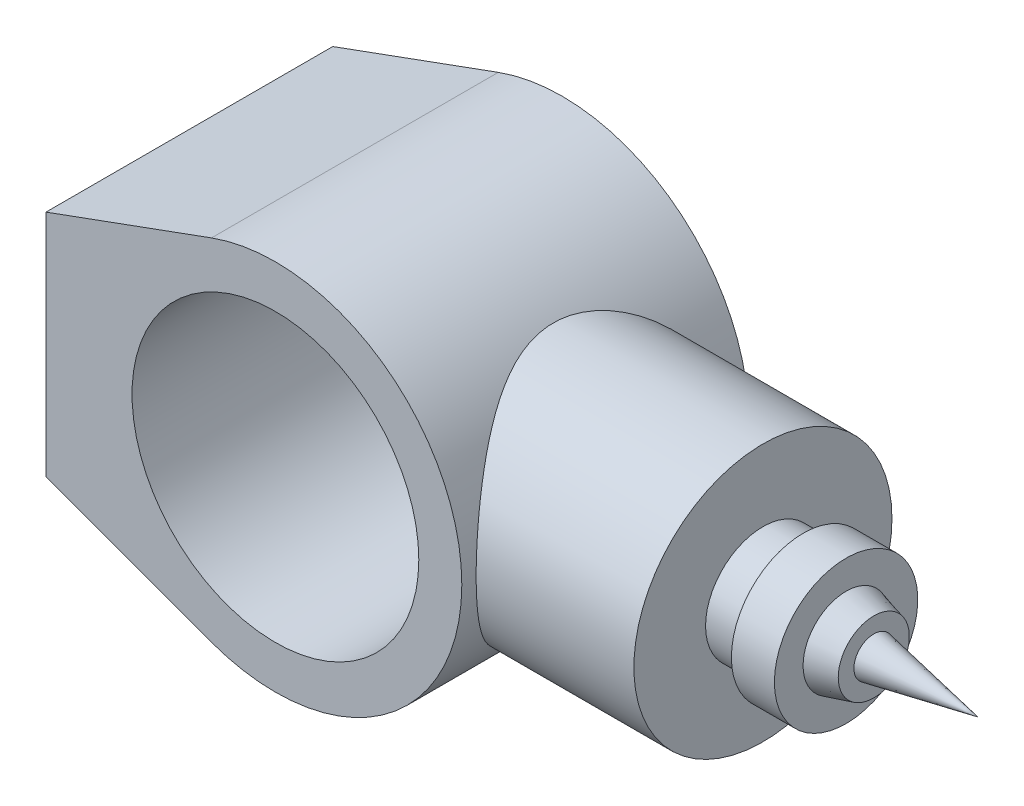
ISO-10303-21;
HEADER;
FILE_DESCRIPTION(('STEP AP214'),'2;1');
FILE_NAME('part.step','',(''),(''),'','','');
FILE_SCHEMA(('AUTOMOTIVE_DESIGN { 1 0 10303 214 1 1 1 1 }'));
ENDSEC;
DATA;
#1=APPLICATION_CONTEXT('core data for automotive mechanical design processes');
#2=APPLICATION_PROTOCOL_DEFINITION('international standard','automotive_design',2000,#1);
#3=PRODUCT_CONTEXT('',#1,'mechanical');
#4=PRODUCT('Part','Part','',(#3));
#5=PRODUCT_RELATED_PRODUCT_CATEGORY('part','',(#4));
#6=PRODUCT_DEFINITION_FORMATION('','',#4);
#7=PRODUCT_DEFINITION_CONTEXT('part definition',#1,'design');
#8=PRODUCT_DEFINITION('design','',#6,#7);
#9=PRODUCT_DEFINITION_SHAPE('','',#8);
#10=(LENGTH_UNIT() NAMED_UNIT(*) SI_UNIT(.MILLI.,.METRE.));
#11=(NAMED_UNIT(*) PLANE_ANGLE_UNIT() SI_UNIT($,.RADIAN.));
#12=(NAMED_UNIT(*) SI_UNIT($,.STERADIAN.) SOLID_ANGLE_UNIT());
#13=UNCERTAINTY_MEASURE_WITH_UNIT(LENGTH_MEASURE(1.E-05),#10,'distance_accuracy_value','');
#14=(GEOMETRIC_REPRESENTATION_CONTEXT(3) GLOBAL_UNCERTAINTY_ASSIGNED_CONTEXT((#13)) GLOBAL_UNIT_ASSIGNED_CONTEXT((#10,
#11,#12)) REPRESENTATION_CONTEXT('',''));
#15=CARTESIAN_POINT('',(0.,0.,0.));
#16=DIRECTION('',(0.,0.,1.));
#17=DIRECTION('',(1.,0.,0.));
#18=AXIS2_PLACEMENT_3D('',#15,#16,#17);
#19=CARTESIAN_POINT('',(0.,0.,50.));
#20=DIRECTION('',(0.,0.,1.));
#21=DIRECTION('',(1.,0.,0.));
#22=AXIS2_PLACEMENT_3D('',#19,#20,#21);
#23=PLANE('',#22);
#24=DIRECTION('',(-0.939410286372225,-0.342794856813887,0.));
#25=VECTOR('',#24,1.);
#26=CARTESIAN_POINT('',(-80.,40.,50.));
#27=LINE('',#26,#25);
#28=CARTESIAN_POINT('',(-22.2816656929027,61.0616686141947,50.));
#29=VERTEX_POINT('',#28);
#30=CARTESIAN_POINT('',(-80.,40.,50.));
#31=VERTEX_POINT('',#30);
#32=EDGE_CURVE('E205',#29,#31,#27,.T.);
#33=ORIENTED_EDGE('',*,*,#32,.T.);
#34=DIRECTION('',(0.,-1.,0.));
#35=VECTOR('',#34,1.);
#36=CARTESIAN_POINT('',(-80.,-40.,50.));
#37=LINE('',#36,#35);
#38=CARTESIAN_POINT('',(-80.,-40.,50.));
#39=VERTEX_POINT('',#38);
#40=EDGE_CURVE('E95',#31,#39,#37,.T.);
#41=ORIENTED_EDGE('',*,*,#40,.T.);
#42=DIRECTION('',(0.939410286372225,-0.342794856813887,0.));
#43=VECTOR('',#42,1.);
#44=CARTESIAN_POINT('',(-80.,-40.,50.));
#45=LINE('',#44,#43);
#46=CARTESIAN_POINT('',(-22.2816656929027,-61.0616686141947,50.));
#47=VERTEX_POINT('',#46);
#48=EDGE_CURVE('E198',#39,#47,#45,.T.);
#49=ORIENTED_EDGE('',*,*,#48,.T.);
#50=CARTESIAN_POINT('',(0.,0.,50.));
#51=DIRECTION('',(0.,0.,1.));
#52=DIRECTION('',(1.,0.,0.));
#53=AXIS2_PLACEMENT_3D('',#50,#51,#52);
#54=CIRCLE('',#53,65.);
#55=EDGE_CURVE('E64',#47,#29,#54,.T.);
#56=ORIENTED_EDGE('',*,*,#55,.T.);
#57=EDGE_LOOP('',(#33,#41,#49,#56));
#58=FACE_BOUND('',#57,.T.);
#59=CARTESIAN_POINT('',(0.,0.,50.));
#60=DIRECTION('',(0.,0.,1.));
#61=DIRECTION('',(1.,0.,0.));
#62=AXIS2_PLACEMENT_3D('',#59,#60,#61);
#63=CIRCLE('',#62,50.);
#64=CARTESIAN_POINT('',(50.,0.,50.));
#65=VERTEX_POINT('',#64);
#66=EDGE_CURVE('E220',#65,#65,#63,.T.);
#67=ORIENTED_EDGE('',*,*,#66,.F.);
#68=EDGE_LOOP('',(#67));
#69=FACE_BOUND('',#68,.T.);
#70=ADVANCED_FACE('F46',(#58,#69),#23,.T.);
#71=CARTESIAN_POINT('',(0.,0.,-50.));
#72=DIRECTION('',(0.,0.,1.));
#73=DIRECTION('',(1.,0.,0.));
#74=AXIS2_PLACEMENT_3D('',#71,#72,#73);
#75=PLANE('',#74);
#76=DIRECTION('',(-0.939410286372225,-0.342794856813887,0.));
#77=VECTOR('',#76,1.);
#78=CARTESIAN_POINT('',(-80.,40.,-50.));
#79=LINE('',#78,#77);
#80=CARTESIAN_POINT('',(-22.2816656929027,61.0616686141947,-50.));
#81=VERTEX_POINT('',#80);
#82=CARTESIAN_POINT('',(-80.,40.,-50.));
#83=VERTEX_POINT('',#82);
#84=EDGE_CURVE('E196',#81,#83,#79,.T.);
#85=ORIENTED_EDGE('',*,*,#84,.F.);
#86=CARTESIAN_POINT('',(0.,0.,-50.));
#87=DIRECTION('',(0.,0.,1.));
#88=DIRECTION('',(1.,0.,0.));
#89=AXIS2_PLACEMENT_3D('',#86,#87,#88);
#90=CIRCLE('',#89,65.);
#91=CARTESIAN_POINT('',(-22.2816656929027,-61.0616686141947,-50.));
#92=VERTEX_POINT('',#91);
#93=EDGE_CURVE('E88',#92,#81,#90,.T.);
#94=ORIENTED_EDGE('',*,*,#93,.F.);
#95=DIRECTION('',(0.939410286372225,-0.342794856813887,0.));
#96=VECTOR('',#95,1.);
#97=CARTESIAN_POINT('',(-80.,-40.,-50.));
#98=LINE('',#97,#96);
#99=CARTESIAN_POINT('',(-80.,-40.,-50.));
#100=VERTEX_POINT('',#99);
#101=EDGE_CURVE('E82',#100,#92,#98,.T.);
#102=ORIENTED_EDGE('',*,*,#101,.F.);
#103=DIRECTION('',(0.,-1.,0.));
#104=VECTOR('',#103,1.);
#105=CARTESIAN_POINT('',(-80.,-40.,-50.));
#106=LINE('',#105,#104);
#107=EDGE_CURVE('E190',#83,#100,#106,.T.);
#108=ORIENTED_EDGE('',*,*,#107,.F.);
#109=EDGE_LOOP('',(#85,#94,#102,#108));
#110=FACE_BOUND('',#109,.T.);
#111=CARTESIAN_POINT('',(0.,0.,-50.));
#112=DIRECTION('',(0.,0.,1.));
#113=DIRECTION('',(1.,0.,0.));
#114=AXIS2_PLACEMENT_3D('',#111,#112,#113);
#115=CIRCLE('',#114,50.);
#116=CARTESIAN_POINT('',(50.,0.,-50.));
#117=VERTEX_POINT('',#116);
#118=EDGE_CURVE('E223',#117,#117,#115,.T.);
#119=ORIENTED_EDGE('',*,*,#118,.T.);
#120=EDGE_LOOP('',(#119));
#121=FACE_BOUND('',#120,.T.);
#122=ADVANCED_FACE('F170',(#110,#121),#75,.F.);
#123=CARTESIAN_POINT('',(-80.,40.,50.));
#124=DIRECTION('',(0.342794856813887,-0.939410286372225,0.));
#125=DIRECTION('',(0.939410286372225,0.342794856813887,0.));
#126=AXIS2_PLACEMENT_3D('',#123,#124,#125);
#127=PLANE('',#126);
#128=ORIENTED_EDGE('',*,*,#84,.T.);
#129=DIRECTION('',(0.,0.,-1.));
#130=VECTOR('',#129,1.);
#131=CARTESIAN_POINT('',(-80.,40.,50.));
#132=LINE('',#131,#130);
#133=EDGE_CURVE('E11',#31,#83,#132,.T.);
#134=ORIENTED_EDGE('',*,*,#133,.F.);
#135=ORIENTED_EDGE('',*,*,#32,.F.);
#136=DIRECTION('',(0.,0.,-1.));
#137=VECTOR('',#136,1.);
#138=CARTESIAN_POINT('',(-22.2816656929027,61.0616686141947,50.));
#139=LINE('',#138,#137);
#140=EDGE_CURVE('E209',#29,#81,#139,.T.);
#141=ORIENTED_EDGE('',*,*,#140,.T.);
#142=EDGE_LOOP('',(#128,#134,#135,#141));
#143=FACE_BOUND('',#142,.T.);
#144=ADVANCED_FACE('F48',(#143),#127,.F.);
#145=CARTESIAN_POINT('',(-80.,-40.,50.));
#146=DIRECTION('',(1.,0.,0.));
#147=DIRECTION('',(0.,0.,-1.));
#148=AXIS2_PLACEMENT_3D('',#145,#146,#147);
#149=PLANE('',#148);
#150=ORIENTED_EDGE('',*,*,#107,.T.);
#151=DIRECTION('',(0.,0.,-1.));
#152=VECTOR('',#151,1.);
#153=CARTESIAN_POINT('',(-80.,-40.,50.));
#154=LINE('',#153,#152);
#155=EDGE_CURVE('E56',#39,#100,#154,.T.);
#156=ORIENTED_EDGE('',*,*,#155,.F.);
#157=ORIENTED_EDGE('',*,*,#40,.F.);
#158=ORIENTED_EDGE('',*,*,#133,.T.);
#159=EDGE_LOOP('',(#150,#156,#157,#158));
#160=FACE_BOUND('',#159,.T.);
#161=ADVANCED_FACE('F184',(#160),#149,.F.);
#162=CARTESIAN_POINT('',(-80.,-40.,50.));
#163=DIRECTION('',(0.342794856813887,0.939410286372225,0.));
#164=DIRECTION('',(-0.939410286372225,0.342794856813887,0.));
#165=AXIS2_PLACEMENT_3D('',#162,#163,#164);
#166=PLANE('',#165);
#167=ORIENTED_EDGE('',*,*,#101,.T.);
#168=DIRECTION('',(0.,0.,-1.));
#169=VECTOR('',#168,1.);
#170=CARTESIAN_POINT('',(-22.2816656929027,-61.0616686141947,50.));
#171=LINE('',#170,#169);
#172=EDGE_CURVE('E200',#47,#92,#171,.T.);
#173=ORIENTED_EDGE('',*,*,#172,.F.);
#174=ORIENTED_EDGE('',*,*,#48,.F.);
#175=ORIENTED_EDGE('',*,*,#155,.T.);
#176=EDGE_LOOP('',(#167,#173,#174,#175));
#177=FACE_BOUND('',#176,.T.);
#178=ADVANCED_FACE('F181',(#177),#166,.F.);
#179=CARTESIAN_POINT('',(0.,0.,50.));
#180=DIRECTION('',(0.,0.,-1.));
#181=DIRECTION('',(-1.,0.,0.));
#182=AXIS2_PLACEMENT_3D('',#179,#180,#181);
#183=CYLINDRICAL_SURFACE('',#182,65.);
#184=CARTESIAN_POINT('',(65.,0.,-45.));
#185=CARTESIAN_POINT('',(65.0000011696057,1.12147330120565,-45.0000012025283));
#186=CARTESIAN_POINT('',(64.9709159765212,2.24292945230778,-44.9580201602482));
#187=CARTESIAN_POINT('',(64.8553068641383,4.47658414079082,-44.790785609369));
#188=CARTESIAN_POINT('',(64.7687842573088,5.58878288911931,-44.6655340035371));
#189=CARTESIAN_POINT('',(64.5403785763001,7.79555151848628,-44.3336771879691));
#190=CARTESIAN_POINT('',(64.3984760503456,8.89011506447751,-44.1270433931238));
#191=CARTESIAN_POINT('',(64.0626457436966,11.0533096019768,-43.6354760134034));
#192=CARTESIAN_POINT('',(63.8687169569864,12.1219400915896,-43.3505409144375));
#193=CARTESIAN_POINT('',(63.4342222744662,14.2212125160505,-42.7078017297046));
#194=CARTESIAN_POINT('',(63.1938918545645,15.2520162370063,-42.3503651251477));
#195=CARTESIAN_POINT('',(62.6709259446924,17.2756280115286,-41.5659763086892));
#196=CARTESIAN_POINT('',(62.3882907364915,18.268436318107,-41.1390245597888));
#197=CARTESIAN_POINT('',(61.786108553932,20.2116697228795,-40.2199419970838));
#198=CARTESIAN_POINT('',(61.4665619062631,21.1620951960855,-39.7278117601444));
#199=CARTESIAN_POINT('',(60.7962171584065,23.0172309124314,-38.6825647509799));
#200=CARTESIAN_POINT('',(60.4454175300334,23.9219389167185,-38.1294449962195));
#201=CARTESIAN_POINT('',(59.6865648974474,25.7601880140228,-36.9151737617935));
#202=CARTESIAN_POINT('',(59.27618815402,26.6893215363404,-36.2488040005491));
#203=CARTESIAN_POINT('',(58.4330275057249,28.4880338622967,-34.8529502059224));
#204=CARTESIAN_POINT('',(58.0002425478181,29.3576098626539,-34.1234632053608));
#205=CARTESIAN_POINT('',(57.1195111836477,31.0364486388513,-32.6040251352403));
#206=CARTESIAN_POINT('',(56.6715447181891,31.8456267033451,-31.8139921794123));
#207=CARTESIAN_POINT('',(55.7691986061138,33.4006700551814,-30.1773036556993));
#208=CARTESIAN_POINT('',(55.3148185876119,34.1465316534289,-29.3306447936721));
#209=CARTESIAN_POINT('',(54.3303114345595,35.6959084068904,-27.4326466159468));
#210=CARTESIAN_POINT('',(53.8005937511269,36.4872853280241,-26.3711450656527));
#211=CARTESIAN_POINT('',(52.7593327891933,37.9773509509911,-24.17604025639));
#212=CARTESIAN_POINT('',(52.2477941160227,38.6760162868262,-23.0424189272517));
#213=CARTESIAN_POINT('',(51.2608149265043,39.9749077721744,-20.7072341856928));
#214=CARTESIAN_POINT('',(50.7853275075273,40.5752630453964,-19.5057627267967));
#215=CARTESIAN_POINT('',(49.8892399163793,41.6721166930025,-17.036931864064));
#216=CARTESIAN_POINT('',(49.4686114171658,42.1686687478853,-15.7696069409943));
#217=CARTESIAN_POINT('',(48.8208029416879,42.9149535309565,-13.5723996352816));
#218=CARTESIAN_POINT('',(48.5738420263557,43.1936925213245,-12.6581208440976));
#219=CARTESIAN_POINT('',(48.1238801744123,43.6944569649788,-10.8035389223551));
#220=CARTESIAN_POINT('',(47.9208721021929,43.9164916250901,-9.86324004407419));
#221=CARTESIAN_POINT('',(47.5660754926548,44.3005296261305,-7.96250438663409));
#222=CARTESIAN_POINT('',(47.4142038087044,44.4626304606427,-7.00210302149487));
#223=CARTESIAN_POINT('',(47.1671263845177,44.7246555122386,-5.06554052628518));
#224=CARTESIAN_POINT('',(47.0719206259529,44.824579749433,-4.08937940131224));
#225=CARTESIAN_POINT('',(46.9418899090943,44.9607388198673,-2.1232364847967));
#226=CARTESIAN_POINT('',(46.9073939345417,44.9966266570423,-1.13320851844658));
#227=CARTESIAN_POINT('',(46.9013571135476,45.0029190462422,0.847248377093852));
#228=CARTESIAN_POINT('',(46.9298161498631,44.9733237202183,1.837677305534));
#229=CARTESIAN_POINT('',(47.0484302849821,44.8492190899201,3.81128752429081));
#230=CARTESIAN_POINT('',(47.13862305521,44.7546701492421,4.79446401850661));
#231=CARTESIAN_POINT('',(47.3768313176079,44.5024241630868,6.74551496467455));
#232=CARTESIAN_POINT('',(47.5248480621437,44.3447257499009,7.71338908473168));
#233=CARTESIAN_POINT('',(47.8621764271841,43.9803320764262,9.56919366964684));
#234=CARTESIAN_POINT('',(48.0484149088864,43.7772163066585,10.4583970625519));
#235=CARTESIAN_POINT('',(48.4609441046406,43.32010640119,12.2144143492181));
#236=CARTESIAN_POINT('',(48.6872496045115,43.0660934784815,13.0812198417583));
#237=CARTESIAN_POINT('',(49.1738509640383,42.5096331932465,14.7898225666927));
#238=CARTESIAN_POINT('',(49.4341648638834,42.2071601049958,15.6316062329481));
#239=CARTESIAN_POINT('',(49.9825182796335,41.5563350032134,17.2876417419013));
#240=CARTESIAN_POINT('',(50.2705534011697,41.2079902580444,18.1018979206949));
#241=CARTESIAN_POINT('',(51.0225431471345,40.2767822129268,20.1137766396802));
#242=CARTESIAN_POINT('',(51.5007434523328,39.6654891440572,21.2930273345177));
#243=CARTESIAN_POINT('',(52.4891158781477,38.348029920852,23.5833678403921));
#244=CARTESIAN_POINT('',(52.9993005340589,37.6418264436726,24.6944305853524));
#245=CARTESIAN_POINT('',(54.0361557973494,36.1376496350166,26.8476775780095));
#246=CARTESIAN_POINT('',(54.5628535785461,35.3395185623559,27.8897384505711));
#247=CARTESIAN_POINT('',(55.6171804467178,33.6558443419671,29.8998791095632));
#248=CARTESIAN_POINT('',(56.1448094104418,32.7703120184234,30.8679680307498));
#249=CARTESIAN_POINT('',(57.1932449701135,30.9045304086319,32.7363921475659));
#250=CARTESIAN_POINT('',(57.7139191350983,29.9233731295192,33.6358963165067));
#251=CARTESIAN_POINT('',(58.7296419536465,27.8771206485979,35.350355349792));
#252=CARTESIAN_POINT('',(59.2246882700661,26.8120178135979,36.1653025097018));
#253=CARTESIAN_POINT('',(60.1756566955639,24.6035209522421,37.7024332048813));
#254=CARTESIAN_POINT('',(60.6316475651595,23.4602711709794,38.4247809320632));
#255=CARTESIAN_POINT('',(61.4931891608211,21.0989507187335,39.7703323765769));
#256=CARTESIAN_POINT('',(61.898755017873,19.8809026570889,40.3935658507715));
#257=CARTESIAN_POINT('',(62.5646802947783,17.6549035875762,41.4059204565395));
#258=CARTESIAN_POINT('',(62.8372982548467,16.6602403417733,41.8163120535009));
#259=CARTESIAN_POINT('',(63.3397164077328,14.6345031625144,42.5675669112335));
#260=CARTESIAN_POINT('',(63.569522535998,13.603434299959,42.9084398107234));
#261=CARTESIAN_POINT('',(63.9815049902596,11.5110112910016,43.5164676119118));
#262=CARTESIAN_POINT('',(64.1637052650743,10.4496726714621,43.7836595836378));
#263=CARTESIAN_POINT('',(64.476639865795,8.30296993183371,44.2409869387356));
#264=CARTESIAN_POINT('',(64.6073730982257,7.21760530180254,44.431120684921));
#265=CARTESIAN_POINT('',(64.8147345736682,5.02649787175023,44.7321113931983));
#266=CARTESIAN_POINT('',(64.8911534961694,3.92069290489763,44.8426616714377));
#267=CARTESIAN_POINT('',(64.9872183357685,1.70145350776208,44.981563734156));
#268=CARTESIAN_POINT('',(65.0068642771874,0.588019080747696,45.0099155538474));
#269=CARTESIAN_POINT('',(64.9889001241945,-1.63741781931566,44.9839662509349));
#270=CARTESIAN_POINT('',(64.9512898349751,-2.74942028747967,44.929664847113));
#271=CARTESIAN_POINT('',(64.819734418053,-4.96298947367603,44.7392747901952));
#272=CARTESIAN_POINT('',(64.7257910494465,-6.06455651648127,44.6031886909653));
#273=CARTESIAN_POINT('',(64.491175703309,-8.18254449212149,44.2620157992034));
#274=CARTESIAN_POINT('',(64.3536808680178,-9.20007959997774,44.0616107864454));
#275=CARTESIAN_POINT('',(64.0337856060908,-11.2121337136589,43.5930613516679));
#276=CARTESIAN_POINT('',(63.8513873855499,-12.2066538475799,43.3249202574929));
#277=CARTESIAN_POINT('',(63.4451725249075,-14.1673074608523,42.7239854011605));
#278=CARTESIAN_POINT('',(63.2213525684632,-15.1334386601223,42.3911864622047));
#279=CARTESIAN_POINT('',(62.736336352677,-17.0327019487273,41.6643868113868));
#280=CARTESIAN_POINT('',(62.4751380044848,-17.965832190203,41.2703826790343));
#281=CARTESIAN_POINT('',(61.8990085085122,-19.8637431772395,40.3931275129008));
#282=CARTESIAN_POINT('',(61.5815209528501,-20.8256806929253,39.9054081529014));
#283=CARTESIAN_POINT('',(60.9142086391395,-22.7035764997345,38.8677076181211));
#284=CARTESIAN_POINT('',(60.5643826081083,-23.6195329786528,38.3177239921568));
#285=CARTESIAN_POINT('',(59.8381347129401,-25.4032558353403,37.1592008079418));
#286=CARTESIAN_POINT('',(59.4616987975441,-26.270996314329,36.5506302507532));
#287=CARTESIAN_POINT('',(58.6884577670336,-27.9557544991496,35.2787474176625));
#288=CARTESIAN_POINT('',(58.2916515549571,-28.7727694681138,34.6154321925309));
#289=CARTESIAN_POINT('',(57.4151711853793,-30.4889708749912,33.1199200847161));
#290=CARTESIAN_POINT('',(56.9328754552547,-31.3785212006928,32.2781812569548));
#291=CARTESIAN_POINT('',(55.9590893109094,-33.0839042215169,30.5278352445589));
#292=CARTESIAN_POINT('',(55.4675975421249,-33.8997259516808,29.6192181500899));
#293=CARTESIAN_POINT('',(54.4860350387397,-35.45586994741,27.7375714933993));
#294=CARTESIAN_POINT('',(53.9959654596117,-36.1961418986443,26.7644997080007));
#295=CARTESIAN_POINT('',(53.0294834997435,-37.5978502361011,24.7568233036382));
#296=CARTESIAN_POINT('',(52.553069328415,-38.2592969946585,23.7222268074148));
#297=CARTESIAN_POINT('',(51.679941347726,-39.4291013564639,21.7149007388747));
#298=CARTESIAN_POINT('',(51.2803372484816,-39.9463152685162,20.7485884228094));
#299=CARTESIAN_POINT('',(50.5123974548912,-40.9130636661729,18.7705314851885));
#300=CARTESIAN_POINT('',(50.1440619804653,-41.3625976757848,17.7587865441704));
#301=CARTESIAN_POINT('',(49.4504928922364,-42.1893301292689,15.693797265063));
#302=CARTESIAN_POINT('',(49.1251906412473,-42.566644202947,14.6406225749502));
#303=CARTESIAN_POINT('',(48.5290098021012,-43.2451098617227,12.4950157035289));
#304=CARTESIAN_POINT('',(48.2581179989952,-43.5462799449171,11.4025931307277));
#305=CARTESIAN_POINT('',(47.8271610412375,-44.0186874861181,9.3921629994351));
#306=CARTESIAN_POINT('',(47.6558419905218,-44.2036946073207,8.47979353570419));
#307=CARTESIAN_POINT('',(47.3627606953031,-44.517583244497,6.63757582668245));
#308=CARTESIAN_POINT('',(47.2409923142224,-44.6464717105955,5.70772976070373));
#309=CARTESIAN_POINT('',(47.05166615705,-44.8459556683364,3.83718735816971));
#310=CARTESIAN_POINT('',(46.9840561376509,-44.9166073394187,2.89650236820514));
#311=CARTESIAN_POINT('',(46.9055698265682,-44.9985645522097,1.01014116515035));
#312=CARTESIAN_POINT('',(46.894694331428,-45.0098692606967,0.0644648821697862));
#313=CARTESIAN_POINT('',(46.9301408777119,-44.972908524549,-1.82506201386804));
#314=CARTESIAN_POINT('',(46.9764888551696,-44.9246160680299,-2.76891160474201));
#315=CARTESIAN_POINT('',(47.1245232303033,-44.7693052695385,-4.64731891289862));
#316=CARTESIAN_POINT('',(47.226209296244,-44.6622872796082,-5.58187668584874));
#317=CARTESIAN_POINT('',(47.4811423262629,-44.3911660407895,-7.43666598606561));
#318=CARTESIAN_POINT('',(47.634452919394,-44.2269923369625,-8.35687836049678));
#319=CARTESIAN_POINT('',(47.9871889035597,-43.8440109221367,-10.1768310643423));
#320=CARTESIAN_POINT('',(48.1866204648689,-43.6251959006593,-11.0765686368372));
#321=CARTESIAN_POINT('',(48.6908782922366,-43.0625185245671,-13.116726178063));
#322=CARTESIAN_POINT('',(49.0093972350599,-42.7008255731353,-14.2488681052183));
#323=CARTESIAN_POINT('',(49.699554494161,-41.8955268796886,-16.4668795226373));
#324=CARTESIAN_POINT('',(50.0712093704162,-41.4518955887103,-17.5527344499461));
#325=CARTESIAN_POINT('',(50.8544123719762,-40.4872212981013,-19.6760329984318));
#326=CARTESIAN_POINT('',(51.2660067549033,-39.9660881554129,-20.7134183727638));
#327=CARTESIAN_POINT('',(52.116211879306,-38.8508952329155,-22.7363587217865));
#328=CARTESIAN_POINT('',(52.5548209260535,-38.2568400254561,-23.7219169406072));
#329=CARTESIAN_POINT('',(53.4579357785502,-36.9847423381263,-25.6613286822633));
#330=CARTESIAN_POINT('',(53.9228021101371,-36.3051118639051,-26.6139712103077));
#331=CARTESIAN_POINT('',(54.8583333343946,-34.8753950985048,-28.4617532840731));
#332=CARTESIAN_POINT('',(55.3289982185488,-34.1253089107936,-29.3568929142368));
#333=CARTESIAN_POINT('',(56.2664339133503,-32.5564691651912,-31.0876310121466));
#334=CARTESIAN_POINT('',(56.7332035093429,-31.7376950080829,-31.923211478402));
#335=CARTESIAN_POINT('',(57.6535165855435,-30.033481652025,-33.5315189390535));
#336=CARTESIAN_POINT('',(58.1070588196762,-29.1480362003111,-34.3042400240121));
#337=CARTESIAN_POINT('',(59.0635284336244,-27.1643113596245,-35.9022819462667));
#338=CARTESIAN_POINT('',(59.5626106290919,-26.0547472869609,-36.7159606163356));
#339=CARTESIAN_POINT('',(60.5176757229357,-23.7521280348398,-38.2458641369291));
#340=CARTESIAN_POINT('',(60.9736519283074,-22.5590599397198,-38.962073861155));
#341=CARTESIAN_POINT('',(61.6149926579414,-20.7127348127311,-39.9558623322098));
#342=CARTESIAN_POINT('',(61.8215919655179,-20.088110583999,-40.2735888165198));
#343=CARTESIAN_POINT('',(62.2191547005856,-18.8206694867556,-40.8812436548858));
#344=CARTESIAN_POINT('',(62.4101203779565,-18.1778552539997,-41.1711760099034));
#345=CARTESIAN_POINT('',(62.7748527233683,-16.875283117665,-41.7219931318356));
#346=CARTESIAN_POINT('',(62.9486230408552,-16.2155288469421,-41.9828840638124));
#347=CARTESIAN_POINT('',(63.2775356475737,-14.8804011558233,-42.4744610119283));
#348=CARTESIAN_POINT('',(63.432679284421,-14.2050288695917,-42.7051492133046));
#349=CARTESIAN_POINT('',(63.8070721968101,-12.4447010544915,-43.25974494481));
#350=CARTESIAN_POINT('',(64.0114184468014,-11.3490405228654,-43.5602757498286));
#351=CARTESIAN_POINT('',(64.3654191982087,-9.12991345978806,-44.078827644396));
#352=CARTESIAN_POINT('',(64.5150820049425,-8.00645117856259,-44.2968612637911));
#353=CARTESIAN_POINT('',(64.7559993187061,-5.74082253729113,-44.6470112993716));
#354=CARTESIAN_POINT('',(64.847297757104,-4.59867091062173,-44.7791923387443));
#355=CARTESIAN_POINT('',(64.9692976296881,-2.30434018473195,-44.9556862638234));
#356=CARTESIAN_POINT('',(64.9999987983895,-1.15216104160189,-44.999998764566));
#357=CARTESIAN_POINT('',(65.,0.,-45.));
#358=B_SPLINE_CURVE_WITH_KNOTS('',3,(#184,#185,#186,#187,#188,#189,#190,#191,#192,#193,#194,
#195,#196,#197,#198,#199,#200,#201,#202,#203,#204,#205,#206,#207,#208,#209,#210,#211,#212,#213,
#214,#215,#216,#217,#218,#219,#220,#221,#222,#223,#224,#225,#226,#227,#228,#229,#230,#231,#232,
#233,#234,#235,#236,#237,#238,#239,#240,#241,#242,#243,#244,#245,#246,#247,#248,#249,#250,#251,
#252,#253,#254,#255,#256,#257,#258,#259,#260,#261,#262,#263,#264,#265,#266,#267,#268,#269,#270,
#271,#272,#273,#274,#275,#276,#277,#278,#279,#280,#281,#282,#283,#284,#285,#286,#287,#288,#289,
#290,#291,#292,#293,#294,#295,#296,#297,#298,#299,#300,#301,#302,#303,#304,#305,#306,#307,#308,
#309,#310,#311,#312,#313,#314,#315,#316,#317,#318,#319,#320,#321,#322,#323,#324,#325,#326,#327,
#328,#329,#330,#331,#332,#333,#334,#335,#336,#337,#338,#339,#340,#341,#342,#343,#344,#345,#346,
#347,#348,#349,#350,#351,#352,#353,#354,#355,#356,#357),.UNSPECIFIED.,.T.,.F.,(4,2,2,2,2,2,2,2,
2,2,2,2,2,2,2,2,2,2,2,2,2,2,2,2,2,2,2,2,2,2,2,2,2,2,2,2,2,2,2,2,2,2,2,2,2,2,2,2,2,2,2,2,2,2,2,2,
2,2,2,2,2,2,2,2,2,2,2,2,2,2,2,2,2,2,2,2,2,2,2,2,2,2,2,2,2,2,4),(0.,3.36323892794144,
6.72640100710137,10.0907454360665,13.4551549250109,16.8029195613731,20.1506619010729,
23.4983746134034,26.8462511096753,30.4871649037346,34.1282499524345,37.7743494260164,
41.4206611917409,45.6939383064405,49.9682903731881,54.2369825353392,58.5034617073671,
61.4625138492405,64.4210852373372,67.3748225577202,70.3285589227263,73.2982527376573,
76.2679410220407,79.2394430998938,82.2110095388412,85.0011411726389,87.7923045951578,
90.584954683776,93.3771628083065,97.6064034875675,101.837312178738,106.075592113262,
110.313347816192,114.596218662803,118.879479402292,123.155037051935,127.429308626693,
130.755998382163,134.082226580387,137.406778235214,140.731400520075,144.068767009318,
147.406132068879,150.743508483461,154.080780688207,157.215791533369,160.350648386749,
163.485756334407,166.621039552604,169.990545063149,173.360183268584,176.73161428665,
180.103227050672,184.047902440152,187.993163521895,191.94103513809,195.888386692538,
199.385185586645,202.88200907258,206.373186157811,209.863514294626,212.700365177753,
215.536864625513,218.370624567028,221.204424293963,224.039508887241,226.874576485218,
229.713151272815,232.55210603787,236.23803941247,239.925124033801,243.616531168718,
247.307706963636,251.081871120678,254.856029735252,258.631324277359,262.406973327354,
266.792058434818,271.177823293658,273.368885604935,275.55963203795,277.749912517597,
279.940034437727,283.398420446896,286.856280978073,290.31153567335,293.766805506531),.UNSPECIFIED.);
#359=CARTESIAN_POINT('',(65.,0.,-45.));
#360=VERTEX_POINT('',#359);
#361=EDGE_CURVE('E135',#360,#360,#358,.T.);
#362=ORIENTED_EDGE('',*,*,#361,.F.);
#363=EDGE_LOOP('',(#362));
#364=FACE_BOUND('',#363,.T.);
#365=ORIENTED_EDGE('',*,*,#93,.T.);
#366=ORIENTED_EDGE('',*,*,#140,.F.);
#367=ORIENTED_EDGE('',*,*,#55,.F.);
#368=ORIENTED_EDGE('',*,*,#172,.T.);
#369=EDGE_LOOP('',(#365,#366,#367,#368));
#370=FACE_BOUND('',#369,.T.);
#371=ADVANCED_FACE('F167',(#364,#370),#183,.T.);
#372=CARTESIAN_POINT('',(0.,0.,50.));
#373=DIRECTION('',(0.,0.,-1.));
#374=DIRECTION('',(-1.,0.,0.));
#375=AXIS2_PLACEMENT_3D('',#372,#373,#374);
#376=CYLINDRICAL_SURFACE('',#375,50.);
#377=ORIENTED_EDGE('',*,*,#66,.T.);
#378=EDGE_LOOP('',(#377));
#379=FACE_BOUND('',#378,.T.);
#380=ORIENTED_EDGE('',*,*,#118,.F.);
#381=EDGE_LOOP('',(#380));
#382=FACE_BOUND('',#381,.T.);
#383=ADVANCED_FACE('F157',(#379,#382),#376,.F.);
#384=CARTESIAN_POINT('',(-80.002,0.,0.));
#385=DIRECTION('',(1.,0.,0.));
#386=DIRECTION('',(0.,0.,-1.));
#387=AXIS2_PLACEMENT_3D('',#384,#385,#386);
#388=CYLINDRICAL_SURFACE('',#387,45.);
#389=CARTESIAN_POINT('',(120.,0.,0.));
#390=DIRECTION('',(1.,0.,0.));
#391=DIRECTION('',(0.,0.,-1.));
#392=AXIS2_PLACEMENT_3D('',#389,#390,#391);
#393=CIRCLE('',#392,45.);
#394=CARTESIAN_POINT('',(120.,0.,-45.));
#395=VERTEX_POINT('',#394);
#396=EDGE_CURVE('E144',#395,#395,#393,.T.);
#397=ORIENTED_EDGE('',*,*,#396,.F.);
#398=EDGE_LOOP('',(#397));
#399=FACE_BOUND('',#398,.T.);
#400=ORIENTED_EDGE('',*,*,#361,.T.);
#401=EDGE_LOOP('',(#400));
#402=FACE_BOUND('',#401,.T.);
#403=ADVANCED_FACE('F146',(#399,#402),#388,.T.);
#404=CARTESIAN_POINT('',(120.,0.,0.));
#405=DIRECTION('',(1.,0.,0.));
#406=DIRECTION('',(0.,0.,-1.));
#407=AXIS2_PLACEMENT_3D('',#404,#405,#406);
#408=PLANE('',#407);
#409=CARTESIAN_POINT('',(120.,0.,0.));
#410=DIRECTION('',(-1.,0.,0.));
#411=DIRECTION('',(0.,0.,1.));
#412=AXIS2_PLACEMENT_3D('',#409,#410,#411);
#413=CIRCLE('',#412,20.);
#414=CARTESIAN_POINT('',(120.,0.,20.));
#415=VERTEX_POINT('',#414);
#416=EDGE_CURVE('E131',#415,#415,#413,.T.);
#417=ORIENTED_EDGE('',*,*,#416,.T.);
#418=EDGE_LOOP('',(#417));
#419=FACE_BOUND('',#418,.T.);
#420=ORIENTED_EDGE('',*,*,#396,.T.);
#421=EDGE_LOOP('',(#420));
#422=FACE_BOUND('',#421,.T.);
#423=ADVANCED_FACE('F154',(#419,#422),#408,.T.);
#424=CARTESIAN_POINT('',(0.,0.,0.));
#425=DIRECTION('',(-1.,0.,0.));
#426=DIRECTION('',(0.,0.,1.));
#427=AXIS2_PLACEMENT_3D('',#424,#425,#426);
#428=CYLINDRICAL_SURFACE('',#427,20.);
#429=CARTESIAN_POINT('',(134.,0.,0.));
#430=DIRECTION('',(-1.,0.,0.));
#431=DIRECTION('',(0.,0.,1.));
#432=AXIS2_PLACEMENT_3D('',#429,#430,#431);
#433=CIRCLE('',#432,20.);
#434=CARTESIAN_POINT('',(134.,0.,20.));
#435=VERTEX_POINT('',#434);
#436=EDGE_CURVE('E127',#435,#435,#433,.T.);
#437=ORIENTED_EDGE('',*,*,#436,.T.);
#438=EDGE_LOOP('',(#437));
#439=FACE_BOUND('',#438,.T.);
#440=ORIENTED_EDGE('',*,*,#416,.F.);
#441=EDGE_LOOP('',(#440));
#442=FACE_BOUND('',#441,.T.);
#443=ADVANCED_FACE('F152',(#439,#442),#428,.T.);
#444=CARTESIAN_POINT('',(134.,-20.,0.));
#445=DIRECTION('',(-1.,0.,0.));
#446=DIRECTION('',(0.,0.,1.));
#447=AXIS2_PLACEMENT_3D('',#444,#445,#446);
#448=PLANE('',#447);
#449=CARTESIAN_POINT('',(134.,0.,0.));
#450=DIRECTION('',(-1.,0.,0.));
#451=DIRECTION('',(0.,0.,1.));
#452=AXIS2_PLACEMENT_3D('',#449,#450,#451);
#453=CIRCLE('',#452,25.);
#454=CARTESIAN_POINT('',(134.,0.,25.));
#455=VERTEX_POINT('',#454);
#456=EDGE_CURVE('E123',#455,#455,#453,.T.);
#457=ORIENTED_EDGE('',*,*,#456,.T.);
#458=EDGE_LOOP('',(#457));
#459=FACE_BOUND('',#458,.T.);
#460=ORIENTED_EDGE('',*,*,#436,.F.);
#461=EDGE_LOOP('',(#460));
#462=FACE_BOUND('',#461,.T.);
#463=ADVANCED_FACE('F162',(#459,#462),#448,.T.);
#464=CARTESIAN_POINT('',(0.,0.,0.));
#465=DIRECTION('',(-1.,0.,0.));
#466=DIRECTION('',(0.,0.,1.));
#467=AXIS2_PLACEMENT_3D('',#464,#465,#466);
#468=CYLINDRICAL_SURFACE('',#467,25.);
#469=CARTESIAN_POINT('',(149.,0.,0.));
#470=DIRECTION('',(-1.,0.,0.));
#471=DIRECTION('',(0.,0.,1.));
#472=AXIS2_PLACEMENT_3D('',#469,#470,#471);
#473=CIRCLE('',#472,25.);
#474=CARTESIAN_POINT('',(149.,0.,25.));
#475=VERTEX_POINT('',#474);
#476=EDGE_CURVE('E119',#475,#475,#473,.T.);
#477=ORIENTED_EDGE('',*,*,#476,.T.);
#478=EDGE_LOOP('',(#477));
#479=FACE_BOUND('',#478,.T.);
#480=ORIENTED_EDGE('',*,*,#456,.F.);
#481=EDGE_LOOP('',(#480));
#482=FACE_BOUND('',#481,.T.);
#483=ADVANCED_FACE('F306',(#479,#482),#468,.T.);
#484=CARTESIAN_POINT('',(149.,-25.,0.));
#485=DIRECTION('',(1.,0.,0.));
#486=DIRECTION('',(0.,0.,-1.));
#487=AXIS2_PLACEMENT_3D('',#484,#485,#486);
#488=PLANE('',#487);
#489=CARTESIAN_POINT('',(149.,0.,0.));
#490=DIRECTION('',(-1.,0.,0.));
#491=DIRECTION('',(0.,0.,1.));
#492=AXIS2_PLACEMENT_3D('',#489,#490,#491);
#493=CIRCLE('',#492,15.);
#494=CARTESIAN_POINT('',(149.,0.,15.));
#495=VERTEX_POINT('',#494);
#496=EDGE_CURVE('E113',#495,#495,#493,.T.);
#497=ORIENTED_EDGE('',*,*,#496,.T.);
#498=EDGE_LOOP('',(#497));
#499=FACE_BOUND('',#498,.T.);
#500=ORIENTED_EDGE('',*,*,#476,.F.);
#501=EDGE_LOOP('',(#500));
#502=FACE_BOUND('',#501,.T.);
#503=ADVANCED_FACE('F315',(#499,#502),#488,.T.);
#504=CARTESIAN_POINT('',(149.,0.,0.));
#505=DIRECTION('',(-1.,0.,0.));
#506=DIRECTION('',(0.,0.,1.));
#507=AXIS2_PLACEMENT_3D('',#504,#505,#506);
#508=CONICAL_SURFACE('',#507,15.,0.263965436068381);
#509=CARTESIAN_POINT('',(158.653629462351,0.,0.));
#510=DIRECTION('',(-1.,0.,0.));
#511=DIRECTION('',(0.,0.,1.));
#512=AXIS2_PLACEMENT_3D('',#509,#510,#511);
#513=CIRCLE('',#512,12.3908932172814);
#514=CARTESIAN_POINT('',(158.653629462351,0.,12.3908932172814));
#515=VERTEX_POINT('',#514);
#516=EDGE_CURVE('E109',#515,#515,#513,.T.);
#517=ORIENTED_EDGE('',*,*,#516,.T.);
#518=EDGE_LOOP('',(#517));
#519=FACE_BOUND('',#518,.T.);
#520=ORIENTED_EDGE('',*,*,#496,.F.);
#521=EDGE_LOOP('',(#520));
#522=FACE_BOUND('',#521,.T.);
#523=ADVANCED_FACE('F325',(#519,#522),#508,.T.);
#524=CARTESIAN_POINT('',(158.653629462351,-12.3908932172814,0.));
#525=DIRECTION('',(1.,0.,0.));
#526=DIRECTION('',(0.,0.,-1.));
#527=AXIS2_PLACEMENT_3D('',#524,#525,#526);
#528=PLANE('',#527);
#529=CARTESIAN_POINT('',(158.653629462351,0.,0.));
#530=DIRECTION('',(-1.,0.,0.));
#531=DIRECTION('',(0.,0.,1.));
#532=AXIS2_PLACEMENT_3D('',#529,#530,#531);
#533=CIRCLE('',#532,6.92396914637287);
#534=CARTESIAN_POINT('',(158.653629462351,0.,6.92396914637287));
#535=VERTEX_POINT('',#534);
#536=EDGE_CURVE('E106',#535,#535,#533,.T.);
#537=ORIENTED_EDGE('',*,*,#536,.T.);
#538=EDGE_LOOP('',(#537));
#539=FACE_BOUND('',#538,.T.);
#540=ORIENTED_EDGE('',*,*,#516,.F.);
#541=EDGE_LOOP('',(#540));
#542=FACE_BOUND('',#541,.T.);
#543=ADVANCED_FACE('F102',(#539,#542),#528,.T.);
#544=CARTESIAN_POINT('',(158.653629462351,0.,0.));
#545=DIRECTION('',(-1.,0.,0.));
#546=DIRECTION('',(0.,0.,1.));
#547=AXIS2_PLACEMENT_3D('',#544,#545,#546);
#548=CONICAL_SURFACE('',#547,6.92396914637287,0.188244097730477);
#549=CARTESIAN_POINT('',(195.,0.,0.));
#550=VERTEX_POINT('',#549);
#551=VERTEX_LOOP('',#550);
#552=FACE_BOUND('',#551,.T.);
#553=ORIENTED_EDGE('',*,*,#536,.F.);
#554=EDGE_LOOP('',(#553));
#555=FACE_BOUND('',#554,.T.);
#556=ADVANCED_FACE('F99',(#552,#555),#548,.T.);
#557=CLOSED_SHELL('',(#70,#122,#144,#161,#178,#371,#383,#403,#423,#443,#463,#483,#503,#523,#543,#556));
#558=MANIFOLD_SOLID_BREP('B2',#557);
#559=ADVANCED_BREP_SHAPE_REPRESENTATION('',(#18,#558),#14);
#560=SHAPE_DEFINITION_REPRESENTATION(#9,#559);
ENDSEC;
END-ISO-10303-21;
